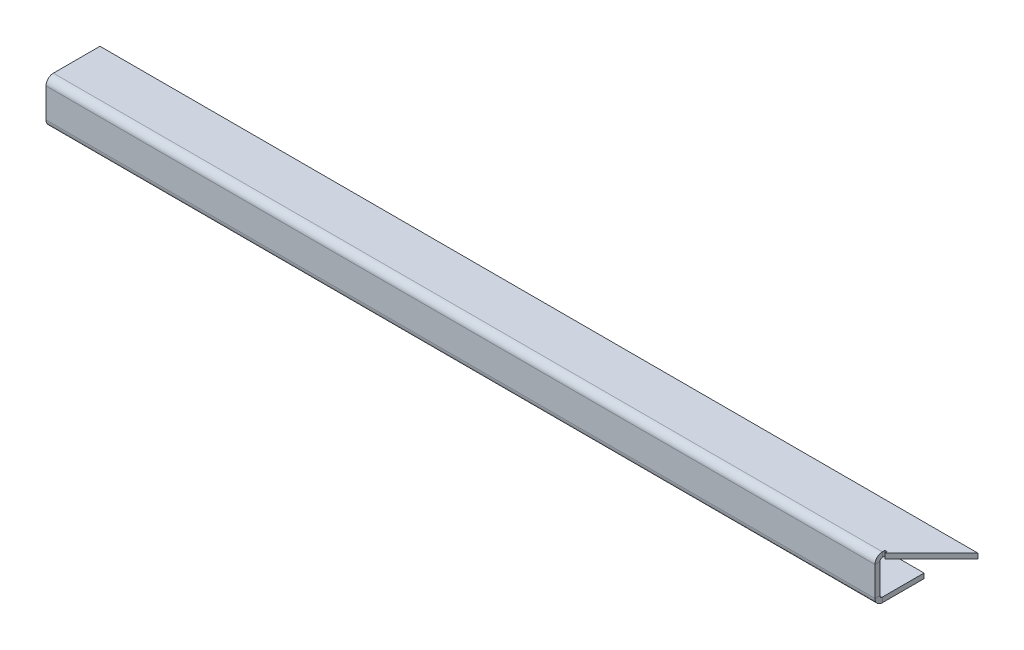
ISO-10303-21;
HEADER;
FILE_DESCRIPTION(('STEP AP214'),'2;1');
FILE_NAME('part.step','',(''),(''),'','','');
FILE_SCHEMA(('AUTOMOTIVE_DESIGN { 1 0 10303 214 1 1 1 1 }'));
ENDSEC;
DATA;
#1=APPLICATION_CONTEXT('core data for automotive mechanical design processes');
#2=APPLICATION_PROTOCOL_DEFINITION('international standard','automotive_design',2000,#1);
#3=PRODUCT_CONTEXT('',#1,'mechanical');
#4=PRODUCT('Part','Part','',(#3));
#5=PRODUCT_RELATED_PRODUCT_CATEGORY('part','',(#4));
#6=PRODUCT_DEFINITION_FORMATION('','',#4);
#7=PRODUCT_DEFINITION_CONTEXT('part definition',#1,'design');
#8=PRODUCT_DEFINITION('design','',#6,#7);
#9=PRODUCT_DEFINITION_SHAPE('','',#8);
#10=(LENGTH_UNIT() NAMED_UNIT(*) SI_UNIT(.MILLI.,.METRE.));
#11=(NAMED_UNIT(*) PLANE_ANGLE_UNIT() SI_UNIT($,.RADIAN.));
#12=(NAMED_UNIT(*) SI_UNIT($,.STERADIAN.) SOLID_ANGLE_UNIT());
#13=UNCERTAINTY_MEASURE_WITH_UNIT(LENGTH_MEASURE(1.E-05),#10,'distance_accuracy_value','');
#14=(GEOMETRIC_REPRESENTATION_CONTEXT(3) GLOBAL_UNCERTAINTY_ASSIGNED_CONTEXT((#13)) GLOBAL_UNIT_ASSIGNED_CONTEXT((#10,
#11,#12)) REPRESENTATION_CONTEXT('',''));
#15=CARTESIAN_POINT('',(0.,0.,0.));
#16=DIRECTION('',(0.,0.,1.));
#17=DIRECTION('',(1.,0.,0.));
#18=AXIS2_PLACEMENT_3D('',#15,#16,#17);
#19=CARTESIAN_POINT('',(-84.5,-8.,1.00000000000002));
#20=DIRECTION('',(1.,0.,0.));
#21=DIRECTION('',(0.,0.,-1.));
#22=AXIS2_PLACEMENT_3D('',#19,#20,#21);
#23=PLANE('',#22);
#24=DIRECTION('',(0.,0.,1.));
#25=VECTOR('',#24,1.);
#26=CARTESIAN_POINT('',(-84.5,-7.50000000000001,0.));
#27=LINE('',#26,#25);
#28=CARTESIAN_POINT('',(-84.5,-7.50000000000001,0.));
#29=VERTEX_POINT('',#28);
#30=CARTESIAN_POINT('',(-84.5,-7.5,1.00000000000003));
#31=VERTEX_POINT('',#30);
#32=EDGE_CURVE('E210',#29,#31,#27,.T.);
#33=ORIENTED_EDGE('',*,*,#32,.T.);
#34=DIRECTION('',(0.,-1.,0.));
#35=VECTOR('',#34,1.);
#36=CARTESIAN_POINT('',(-84.5,-8.,1.00000000000002));
#37=LINE('',#36,#35);
#38=CARTESIAN_POINT('',(-84.5,-1.50000000000001,0.999999999999986));
#39=VERTEX_POINT('',#38);
#40=EDGE_CURVE('E233',#39,#31,#37,.T.);
#41=ORIENTED_EDGE('',*,*,#40,.F.);
#42=DIRECTION('',(0.,0.,1.));
#43=VECTOR('',#42,1.);
#44=CARTESIAN_POINT('',(-84.5,-1.50000000000001,0.));
#45=LINE('',#44,#43);
#46=CARTESIAN_POINT('',(-84.5,-1.5,0.));
#47=VERTEX_POINT('',#46);
#48=EDGE_CURVE('E224',#47,#39,#45,.T.);
#49=ORIENTED_EDGE('',*,*,#48,.F.);
#50=DIRECTION('',(0.,-1.,0.));
#51=VECTOR('',#50,1.);
#52=CARTESIAN_POINT('',(-84.5,-8.,0.));
#53=LINE('',#52,#51);
#54=EDGE_CURVE('E232',#47,#29,#53,.T.);
#55=ORIENTED_EDGE('',*,*,#54,.T.);
#56=EDGE_LOOP('',(#33,#41,#49,#55));
#57=FACE_BOUND('',#56,.T.);
#58=ADVANCED_FACE('F45',(#57),#23,.F.);
#59=CARTESIAN_POINT('',(84.5,-0.999999999999997,0.999999999999969));
#60=DIRECTION('',(-1.,0.,0.));
#61=DIRECTION('',(0.,0.,1.));
#62=AXIS2_PLACEMENT_3D('',#59,#60,#61);
#63=PLANE('',#62);
#64=DIRECTION('',(0.,0.,1.));
#65=VECTOR('',#64,1.);
#66=CARTESIAN_POINT('',(84.5,-7.50000000000001,0.));
#67=LINE('',#66,#65);
#68=CARTESIAN_POINT('',(84.5,-7.50000000000001,0.));
#69=VERTEX_POINT('',#68);
#70=CARTESIAN_POINT('',(84.5,-7.50000000000001,0.999999999999993));
#71=VERTEX_POINT('',#70);
#72=EDGE_CURVE('E216',#69,#71,#67,.T.);
#73=ORIENTED_EDGE('',*,*,#72,.F.);
#74=DIRECTION('',(0.,1.,0.));
#75=VECTOR('',#74,1.);
#76=CARTESIAN_POINT('',(84.5,-1.,0.));
#77=LINE('',#76,#75);
#78=CARTESIAN_POINT('',(84.5,-1.5,0.));
#79=VERTEX_POINT('',#78);
#80=EDGE_CURVE('E236',#69,#79,#77,.T.);
#81=ORIENTED_EDGE('',*,*,#80,.T.);
#82=DIRECTION('',(0.,0.,1.));
#83=VECTOR('',#82,1.);
#84=CARTESIAN_POINT('',(84.5,-1.5,0.));
#85=LINE('',#84,#83);
#86=CARTESIAN_POINT('',(84.5,-1.5,0.999999999999971));
#87=VERTEX_POINT('',#86);
#88=EDGE_CURVE('E219',#79,#87,#85,.T.);
#89=ORIENTED_EDGE('',*,*,#88,.T.);
#90=DIRECTION('',(0.,1.,0.));
#91=VECTOR('',#90,1.);
#92=CARTESIAN_POINT('',(84.5,-0.999999999999997,0.999999999999969));
#93=LINE('',#92,#91);
#94=EDGE_CURVE('E235',#71,#87,#93,.T.);
#95=ORIENTED_EDGE('',*,*,#94,.F.);
#96=EDGE_LOOP('',(#73,#81,#89,#95));
#97=FACE_BOUND('',#96,.T.);
#98=ADVANCED_FACE('F353',(#97),#63,.F.);
#99=CARTESIAN_POINT('',(0.,0.,0.999999999999981));
#100=DIRECTION('',(0.,0.,-1.));
#101=DIRECTION('',(0.,1.,0.));
#102=AXIS2_PLACEMENT_3D('',#99,#100,#101);
#103=PLANE('',#102);
#104=DIRECTION('',(-1.,0.,0.));
#105=VECTOR('',#104,1.);
#106=CARTESIAN_POINT('',(-84.5,-7.5,1.00000000000003));
#107=LINE('',#106,#105);
#108=EDGE_CURVE('E163',#31,#71,#107,.F.);
#109=ORIENTED_EDGE('',*,*,#108,.T.);
#110=ORIENTED_EDGE('',*,*,#94,.T.);
#111=DIRECTION('',(1.,0.,0.));
#112=VECTOR('',#111,1.);
#113=CARTESIAN_POINT('',(0.,-1.5,0.999999999999986));
#114=LINE('',#113,#112);
#115=EDGE_CURVE('E227',#39,#87,#114,.T.);
#116=ORIENTED_EDGE('',*,*,#115,.F.);
#117=ORIENTED_EDGE('',*,*,#40,.T.);
#118=EDGE_LOOP('',(#109,#110,#116,#117));
#119=FACE_BOUND('',#118,.T.);
#120=ADVANCED_FACE('F359',(#119),#103,.F.);
#121=CARTESIAN_POINT('',(0.,0.,0.));
#122=DIRECTION('',(0.,0.,-1.));
#123=DIRECTION('',(0.,1.,0.));
#124=AXIS2_PLACEMENT_3D('',#121,#122,#123);
#125=PLANE('',#124);
#126=ORIENTED_EDGE('',*,*,#80,.F.);
#127=DIRECTION('',(-1.,0.,0.));
#128=VECTOR('',#127,1.);
#129=CARTESIAN_POINT('',(-84.5,-7.50000000000001,0.));
#130=LINE('',#129,#128);
#131=EDGE_CURVE('E62',#29,#69,#130,.F.);
#132=ORIENTED_EDGE('',*,*,#131,.F.);
#133=ORIENTED_EDGE('',*,*,#54,.F.);
#134=DIRECTION('',(-1.,0.,0.));
#135=VECTOR('',#134,1.);
#136=CARTESIAN_POINT('',(84.5,-1.5,0.));
#137=LINE('',#136,#135);
#138=EDGE_CURVE('E222',#79,#47,#137,.T.);
#139=ORIENTED_EDGE('',*,*,#138,.F.);
#140=EDGE_LOOP('',(#126,#132,#133,#139));
#141=FACE_BOUND('',#140,.T.);
#142=ADVANCED_FACE('F409',(#141),#125,.T.);
#143=CARTESIAN_POINT('',(-84.5,-1.,0.));
#144=DIRECTION('',(-1.,0.,0.));
#145=DIRECTION('',(0.,0.,1.));
#146=AXIS2_PLACEMENT_3D('',#143,#144,#145);
#147=PLANE('',#146);
#148=DIRECTION('',(0.,0.,1.));
#149=VECTOR('',#148,1.);
#150=CARTESIAN_POINT('',(-84.5,-1.,0.));
#151=LINE('',#150,#149);
#152=CARTESIAN_POINT('',(-84.5,-1.,-10.));
#153=VERTEX_POINT('',#152);
#154=CARTESIAN_POINT('',(-84.5,-1.,-0.500000000000017));
#155=VERTEX_POINT('',#154);
#156=EDGE_CURVE('E280',#153,#155,#151,.T.);
#157=ORIENTED_EDGE('',*,*,#156,.T.);
#158=DIRECTION('',(0.,1.,0.));
#159=VECTOR('',#158,1.);
#160=CARTESIAN_POINT('',(-84.5,-1.,-0.499999999999998));
#161=LINE('',#160,#159);
#162=CARTESIAN_POINT('',(-84.5,0.,-0.500000000000004));
#163=VERTEX_POINT('',#162);
#164=EDGE_CURVE('E247',#155,#163,#161,.T.);
#165=ORIENTED_EDGE('',*,*,#164,.T.);
#166=DIRECTION('',(0.,0.,1.));
#167=VECTOR('',#166,1.);
#168=CARTESIAN_POINT('',(-84.5,0.,0.));
#169=LINE('',#168,#167);
#170=CARTESIAN_POINT('',(-84.5,0.,-10.));
#171=VERTEX_POINT('',#170);
#172=EDGE_CURVE('E265',#171,#163,#169,.T.);
#173=ORIENTED_EDGE('',*,*,#172,.F.);
#174=DIRECTION('',(0.,1.,0.));
#175=VECTOR('',#174,1.);
#176=CARTESIAN_POINT('',(-84.5,-1.,-10.));
#177=LINE('',#176,#175);
#178=EDGE_CURVE('E295',#153,#171,#177,.T.);
#179=ORIENTED_EDGE('',*,*,#178,.F.);
#180=EDGE_LOOP('',(#157,#165,#173,#179));
#181=FACE_BOUND('',#180,.T.);
#182=ADVANCED_FACE('F47',(#181),#147,.T.);
#183=CARTESIAN_POINT('',(84.5,-1.,0.));
#184=DIRECTION('',(0.707106781186544,0.,0.707106781186551));
#185=DIRECTION('',(0.707106781186551,0.,-0.707106781186544));
#186=AXIS2_PLACEMENT_3D('',#183,#184,#185);
#187=PLANE('',#186);
#188=DIRECTION('',(0.707106781186551,0.,-0.707106781186544));
#189=VECTOR('',#188,1.);
#190=CARTESIAN_POINT('',(84.5,0.,0.));
#191=LINE('',#190,#189);
#192=CARTESIAN_POINT('',(85.,0.,-0.500000000000026));
#193=VERTEX_POINT('',#192);
#194=CARTESIAN_POINT('',(94.5000000000001,0.,-10.));
#195=VERTEX_POINT('',#194);
#196=EDGE_CURVE('E291',#193,#195,#191,.T.);
#197=ORIENTED_EDGE('',*,*,#196,.F.);
#198=DIRECTION('',(0.,1.,0.));
#199=VECTOR('',#198,1.);
#200=CARTESIAN_POINT('',(85.,-1.,-0.500000000000026));
#201=LINE('',#200,#199);
#202=CARTESIAN_POINT('',(85.,-1.,-0.500000000000026));
#203=VERTEX_POINT('',#202);
#204=EDGE_CURVE('E273',#203,#193,#201,.T.);
#205=ORIENTED_EDGE('',*,*,#204,.F.);
#206=DIRECTION('',(0.707106781186551,0.,-0.707106781186544));
#207=VECTOR('',#206,1.);
#208=CARTESIAN_POINT('',(84.5,-1.,0.));
#209=LINE('',#208,#207);
#210=CARTESIAN_POINT('',(94.5000000000001,-1.,-10.));
#211=VERTEX_POINT('',#210);
#212=EDGE_CURVE('E283',#203,#211,#209,.T.);
#213=ORIENTED_EDGE('',*,*,#212,.T.);
#214=DIRECTION('',(0.,1.,0.));
#215=VECTOR('',#214,1.);
#216=CARTESIAN_POINT('',(94.5000000000001,-1.,-10.));
#217=LINE('',#216,#215);
#218=EDGE_CURVE('E289',#211,#195,#217,.T.);
#219=ORIENTED_EDGE('',*,*,#218,.T.);
#220=EDGE_LOOP('',(#197,#205,#213,#219));
#221=FACE_BOUND('',#220,.T.);
#222=ADVANCED_FACE('F398',(#221),#187,.T.);
#223=CARTESIAN_POINT('',(0.,-1.,0.));
#224=DIRECTION('',(0.,-1.,0.));
#225=DIRECTION('',(0.,0.,-1.));
#226=AXIS2_PLACEMENT_3D('',#223,#224,#225);
#227=PLANE('',#226);
#228=DIRECTION('',(0.,0.,-1.));
#229=VECTOR('',#228,1.);
#230=CARTESIAN_POINT('',(84.5,-1.,-0.500000000000035));
#231=LINE('',#230,#229);
#232=CARTESIAN_POINT('',(84.5,-1.,-0.500000000000035));
#233=VERTEX_POINT('',#232);
#234=CARTESIAN_POINT('',(84.5,-1.,-1.00000000000003));
#235=VERTEX_POINT('',#234);
#236=EDGE_CURVE('E70',#233,#235,#231,.T.);
#237=ORIENTED_EDGE('',*,*,#236,.F.);
#238=DIRECTION('',(-1.,0.,0.));
#239=VECTOR('',#238,1.);
#240=CARTESIAN_POINT('',(-84.5,-1.,-0.499999999999998));
#241=LINE('',#240,#239);
#242=EDGE_CURVE('E253',#155,#233,#241,.F.);
#243=ORIENTED_EDGE('',*,*,#242,.F.);
#244=ORIENTED_EDGE('',*,*,#156,.F.);
#245=DIRECTION('',(-1.,0.,0.));
#246=VECTOR('',#245,1.);
#247=CARTESIAN_POINT('',(-84.5,-1.,-10.));
#248=LINE('',#247,#246);
#249=EDGE_CURVE('E286',#211,#153,#248,.T.);
#250=ORIENTED_EDGE('',*,*,#249,.F.);
#251=ORIENTED_EDGE('',*,*,#212,.F.);
#252=DIRECTION('',(0.,0.,1.));
#253=VECTOR('',#252,1.);
#254=CARTESIAN_POINT('',(85.,-1.,-1.00000000000003));
#255=LINE('',#254,#253);
#256=CARTESIAN_POINT('',(85.,-1.,-1.00000000000003));
#257=VERTEX_POINT('',#256);
#258=EDGE_CURVE('E270',#257,#203,#255,.T.);
#259=ORIENTED_EDGE('',*,*,#258,.F.);
#260=DIRECTION('',(1.,0.,0.));
#261=VECTOR('',#260,1.);
#262=CARTESIAN_POINT('',(84.5,-1.,-1.00000000000003));
#263=LINE('',#262,#261);
#264=EDGE_CURVE('E266',#235,#257,#263,.T.);
#265=ORIENTED_EDGE('',*,*,#264,.F.);
#266=EDGE_LOOP('',(#237,#243,#244,#250,#251,#259,#265));
#267=FACE_BOUND('',#266,.T.);
#268=ADVANCED_FACE('F394',(#267),#227,.T.);
#269=CARTESIAN_POINT('',(0.,0.,0.));
#270=DIRECTION('',(0.,-1.,0.));
#271=DIRECTION('',(0.,0.,-1.));
#272=AXIS2_PLACEMENT_3D('',#269,#270,#271);
#273=PLANE('',#272);
#274=DIRECTION('',(-1.,0.,0.));
#275=VECTOR('',#274,1.);
#276=CARTESIAN_POINT('',(-84.5,0.,-0.500000000000004));
#277=LINE('',#276,#275);
#278=CARTESIAN_POINT('',(84.5,0.,-0.500000000000035));
#279=VERTEX_POINT('',#278);
#280=EDGE_CURVE('E241',#163,#279,#277,.F.);
#281=ORIENTED_EDGE('',*,*,#280,.T.);
#282=DIRECTION('',(0.,0.,1.));
#283=VECTOR('',#282,1.);
#284=CARTESIAN_POINT('',(84.5,0.,0.));
#285=LINE('',#284,#283);
#286=CARTESIAN_POINT('',(84.5,0.,-1.00000000000003));
#287=VERTEX_POINT('',#286);
#288=EDGE_CURVE('E11',#287,#279,#285,.T.);
#289=ORIENTED_EDGE('',*,*,#288,.F.);
#290=DIRECTION('',(-1.,0.,0.));
#291=VECTOR('',#290,1.);
#292=CARTESIAN_POINT('',(0.,0.,-1.00000000000003));
#293=LINE('',#292,#291);
#294=CARTESIAN_POINT('',(85.,0.,-1.00000000000003));
#295=VERTEX_POINT('',#294);
#296=EDGE_CURVE('E54',#295,#287,#293,.T.);
#297=ORIENTED_EDGE('',*,*,#296,.F.);
#298=DIRECTION('',(0.,0.,-1.));
#299=VECTOR('',#298,1.);
#300=CARTESIAN_POINT('',(85.,0.,0.));
#301=LINE('',#300,#299);
#302=EDGE_CURVE('E297',#193,#295,#301,.T.);
#303=ORIENTED_EDGE('',*,*,#302,.F.);
#304=ORIENTED_EDGE('',*,*,#196,.T.);
#305=DIRECTION('',(-1.,0.,0.));
#306=VECTOR('',#305,1.);
#307=CARTESIAN_POINT('',(-84.5,0.,-10.));
#308=LINE('',#307,#306);
#309=EDGE_CURVE('E284',#195,#171,#308,.T.);
#310=ORIENTED_EDGE('',*,*,#309,.T.);
#311=ORIENTED_EDGE('',*,*,#172,.T.);
#312=EDGE_LOOP('',(#281,#289,#297,#303,#304,#310,#311));
#313=FACE_BOUND('',#312,.T.);
#314=ADVANCED_FACE('F397',(#313),#273,.F.);
#315=CARTESIAN_POINT('',(-84.5,-1.,-10.));
#316=DIRECTION('',(0.,0.,-1.));
#317=DIRECTION('',(-1.,0.,0.));
#318=AXIS2_PLACEMENT_3D('',#315,#316,#317);
#319=PLANE('',#318);
#320=ORIENTED_EDGE('',*,*,#309,.F.);
#321=ORIENTED_EDGE('',*,*,#218,.F.);
#322=ORIENTED_EDGE('',*,*,#249,.T.);
#323=ORIENTED_EDGE('',*,*,#178,.T.);
#324=EDGE_LOOP('',(#320,#321,#322,#323));
#325=FACE_BOUND('',#324,.T.);
#326=ADVANCED_FACE('F392',(#325),#319,.T.);
#327=CARTESIAN_POINT('',(84.5,-1.,-0.500000000000035));
#328=DIRECTION('',(1.,0.,0.));
#329=DIRECTION('',(0.,0.,-1.));
#330=AXIS2_PLACEMENT_3D('',#327,#328,#329);
#331=PLANE('',#330);
#332=DIRECTION('',(0.,1.,0.));
#333=VECTOR('',#332,1.);
#334=CARTESIAN_POINT('',(84.5,-1.,-1.00000000000003));
#335=LINE('',#334,#333);
#336=EDGE_CURVE('E269',#235,#287,#335,.T.);
#337=ORIENTED_EDGE('',*,*,#336,.T.);
#338=ORIENTED_EDGE('',*,*,#288,.T.);
#339=DIRECTION('',(0.,1.,0.));
#340=VECTOR('',#339,1.);
#341=CARTESIAN_POINT('',(84.5,-1.,-0.500000000000035));
#342=LINE('',#341,#340);
#343=EDGE_CURVE('E258',#233,#279,#342,.T.);
#344=ORIENTED_EDGE('',*,*,#343,.F.);
#345=ORIENTED_EDGE('',*,*,#236,.T.);
#346=EDGE_LOOP('',(#337,#338,#344,#345));
#347=FACE_BOUND('',#346,.T.);
#348=ADVANCED_FACE('F388',(#347),#331,.T.);
#349=CARTESIAN_POINT('',(84.5,-1.,-1.00000000000003));
#350=DIRECTION('',(0.,0.,1.));
#351=DIRECTION('',(0.,-1.,0.));
#352=AXIS2_PLACEMENT_3D('',#349,#350,#351);
#353=PLANE('',#352);
#354=DIRECTION('',(0.,1.,0.));
#355=VECTOR('',#354,1.);
#356=CARTESIAN_POINT('',(85.,-1.,-1.00000000000003));
#357=LINE('',#356,#355);
#358=EDGE_CURVE('E261',#257,#295,#357,.T.);
#359=ORIENTED_EDGE('',*,*,#358,.T.);
#360=ORIENTED_EDGE('',*,*,#296,.T.);
#361=ORIENTED_EDGE('',*,*,#336,.F.);
#362=ORIENTED_EDGE('',*,*,#264,.T.);
#363=EDGE_LOOP('',(#359,#360,#361,#362));
#364=FACE_BOUND('',#363,.T.);
#365=ADVANCED_FACE('F384',(#364),#353,.T.);
#366=CARTESIAN_POINT('',(85.,-1.,-1.00000000000003));
#367=DIRECTION('',(-1.,0.,0.));
#368=DIRECTION('',(0.,0.,1.));
#369=AXIS2_PLACEMENT_3D('',#366,#367,#368);
#370=PLANE('',#369);
#371=ORIENTED_EDGE('',*,*,#204,.T.);
#372=ORIENTED_EDGE('',*,*,#302,.T.);
#373=ORIENTED_EDGE('',*,*,#358,.F.);
#374=ORIENTED_EDGE('',*,*,#258,.T.);
#375=EDGE_LOOP('',(#371,#372,#373,#374));
#376=FACE_BOUND('',#375,.T.);
#377=ADVANCED_FACE('F377',(#376),#370,.T.);
#378=CARTESIAN_POINT('',(84.5,-1.5,-0.500000000000032));
#379=DIRECTION('',(1.,0.,0.));
#380=DIRECTION('',(0.,0.,-1.));
#381=AXIS2_PLACEMENT_3D('',#378,#379,#380);
#382=PLANE('',#381);
#383=ORIENTED_EDGE('',*,*,#88,.F.);
#384=CARTESIAN_POINT('',(84.5,-1.5,-0.500000000000032));
#385=DIRECTION('',(-1.,0.,0.));
#386=DIRECTION('',(0.,0.,1.));
#387=AXIS2_PLACEMENT_3D('',#384,#385,#386);
#388=CIRCLE('',#387,0.500000000000003);
#389=EDGE_CURVE('E250',#233,#79,#388,.F.);
#390=ORIENTED_EDGE('',*,*,#389,.F.);
#391=ORIENTED_EDGE('',*,*,#343,.T.);
#392=CARTESIAN_POINT('',(84.5,-1.5,-0.500000000000032));
#393=DIRECTION('',(-1.,0.,0.));
#394=DIRECTION('',(0.,0.,1.));
#395=AXIS2_PLACEMENT_3D('',#392,#393,#394);
#396=CIRCLE('',#395,1.5);
#397=EDGE_CURVE('E243',#279,#87,#396,.F.);
#398=ORIENTED_EDGE('',*,*,#397,.T.);
#399=EDGE_LOOP('',(#383,#390,#391,#398));
#400=FACE_BOUND('',#399,.T.);
#401=ADVANCED_FACE('F374',(#400),#382,.T.);
#402=CARTESIAN_POINT('',(-84.5,-1.5,-0.499999999999995));
#403=DIRECTION('',(1.,0.,0.));
#404=DIRECTION('',(0.,0.,-1.));
#405=AXIS2_PLACEMENT_3D('',#402,#403,#404);
#406=PLANE('',#405);
#407=CARTESIAN_POINT('',(-84.5,-1.5,-0.499999999999995));
#408=DIRECTION('',(-1.,0.,0.));
#409=DIRECTION('',(0.,0.,1.));
#410=AXIS2_PLACEMENT_3D('',#407,#408,#409);
#411=CIRCLE('',#410,0.500000000000003);
#412=EDGE_CURVE('E238',#47,#155,#411,.T.);
#413=ORIENTED_EDGE('',*,*,#412,.F.);
#414=ORIENTED_EDGE('',*,*,#48,.T.);
#415=CARTESIAN_POINT('',(-84.5,-1.5,-0.499999999999995));
#416=DIRECTION('',(-1.,0.,0.));
#417=DIRECTION('',(0.,0.,1.));
#418=AXIS2_PLACEMENT_3D('',#415,#416,#417);
#419=CIRCLE('',#418,1.5);
#420=EDGE_CURVE('E244',#39,#163,#419,.T.);
#421=ORIENTED_EDGE('',*,*,#420,.T.);
#422=ORIENTED_EDGE('',*,*,#164,.F.);
#423=EDGE_LOOP('',(#413,#414,#421,#422));
#424=FACE_BOUND('',#423,.T.);
#425=ADVANCED_FACE('F368',(#424),#406,.F.);
#426=CARTESIAN_POINT('',(-84.5,-1.5,-0.499999999999995));
#427=DIRECTION('',(-1.,0.,0.));
#428=DIRECTION('',(0.,0.,1.));
#429=AXIS2_PLACEMENT_3D('',#426,#427,#428);
#430=CYLINDRICAL_SURFACE('',#429,1.5);
#431=ORIENTED_EDGE('',*,*,#280,.F.);
#432=ORIENTED_EDGE('',*,*,#420,.F.);
#433=ORIENTED_EDGE('',*,*,#115,.T.);
#434=ORIENTED_EDGE('',*,*,#397,.F.);
#435=EDGE_LOOP('',(#431,#432,#433,#434));
#436=FACE_BOUND('',#435,.T.);
#437=ADVANCED_FACE('F364',(#436),#430,.T.);
#438=CARTESIAN_POINT('',(-84.5,-1.5,-0.499999999999995));
#439=DIRECTION('',(-1.,0.,0.));
#440=DIRECTION('',(0.,0.,1.));
#441=AXIS2_PLACEMENT_3D('',#438,#439,#440);
#442=CYLINDRICAL_SURFACE('',#441,0.500000000000003);
#443=ORIENTED_EDGE('',*,*,#242,.T.);
#444=ORIENTED_EDGE('',*,*,#389,.T.);
#445=ORIENTED_EDGE('',*,*,#138,.T.);
#446=ORIENTED_EDGE('',*,*,#412,.T.);
#447=EDGE_LOOP('',(#443,#444,#445,#446));
#448=FACE_BOUND('',#447,.T.);
#449=ADVANCED_FACE('F367',(#448),#442,.F.);
#450=CARTESIAN_POINT('',(84.5,-7.50000000000001,-0.500000000000012));
#451=DIRECTION('',(1.,0.,0.));
#452=DIRECTION('',(0.,0.,-1.));
#453=AXIS2_PLACEMENT_3D('',#450,#451,#452);
#454=PLANE('',#453);
#455=DIRECTION('',(0.,-1.,0.));
#456=VECTOR('',#455,1.);
#457=CARTESIAN_POINT('',(84.5,-8.00000000000001,-0.500000000000006));
#458=LINE('',#457,#456);
#459=CARTESIAN_POINT('',(84.5,-8.00000000000001,-0.500000000000008));
#460=VERTEX_POINT('',#459);
#461=CARTESIAN_POINT('',(84.5,-9.00000000000001,-0.500000000000001));
#462=VERTEX_POINT('',#461);
#463=EDGE_CURVE('E312',#460,#462,#458,.T.);
#464=ORIENTED_EDGE('',*,*,#463,.F.);
#465=CARTESIAN_POINT('',(84.5,-7.50000000000001,-0.500000000000012));
#466=DIRECTION('',(-1.,0.,0.));
#467=DIRECTION('',(0.,0.,1.));
#468=AXIS2_PLACEMENT_3D('',#465,#466,#467);
#469=CIRCLE('',#468,0.5);
#470=EDGE_CURVE('E166',#69,#460,#469,.F.);
#471=ORIENTED_EDGE('',*,*,#470,.F.);
#472=ORIENTED_EDGE('',*,*,#72,.T.);
#473=CARTESIAN_POINT('',(84.5,-7.50000000000001,-0.500000000000012));
#474=DIRECTION('',(-1.,0.,0.));
#475=DIRECTION('',(0.,0.,1.));
#476=AXIS2_PLACEMENT_3D('',#473,#474,#475);
#477=CIRCLE('',#476,1.5);
#478=EDGE_CURVE('E209',#71,#462,#477,.F.);
#479=ORIENTED_EDGE('',*,*,#478,.T.);
#480=EDGE_LOOP('',(#464,#471,#472,#479));
#481=FACE_BOUND('',#480,.T.);
#482=ADVANCED_FACE('F372',(#481),#454,.T.);
#483=CARTESIAN_POINT('',(-84.5,-7.50000000000001,-0.499999999999975));
#484=DIRECTION('',(1.,0.,0.));
#485=DIRECTION('',(0.,0.,-1.));
#486=AXIS2_PLACEMENT_3D('',#483,#484,#485);
#487=PLANE('',#486);
#488=CARTESIAN_POINT('',(-84.5,-7.50000000000001,-0.499999999999975));
#489=DIRECTION('',(-1.,0.,0.));
#490=DIRECTION('',(0.,0.,1.));
#491=AXIS2_PLACEMENT_3D('',#488,#489,#490);
#492=CIRCLE('',#491,0.5);
#493=CARTESIAN_POINT('',(-84.5,-8.00000000000001,-0.499999999999972));
#494=VERTEX_POINT('',#493);
#495=EDGE_CURVE('E173',#494,#29,#492,.T.);
#496=ORIENTED_EDGE('',*,*,#495,.F.);
#497=DIRECTION('',(0.,-1.,0.));
#498=VECTOR('',#497,1.);
#499=CARTESIAN_POINT('',(-84.5,-8.00000000000001,-0.499999999999974));
#500=LINE('',#499,#498);
#501=CARTESIAN_POINT('',(-84.5,-9.00000000000001,-0.499999999999967));
#502=VERTEX_POINT('',#501);
#503=EDGE_CURVE('E170',#494,#502,#500,.T.);
#504=ORIENTED_EDGE('',*,*,#503,.T.);
#505=CARTESIAN_POINT('',(-84.5,-7.50000000000001,-0.499999999999975));
#506=DIRECTION('',(-1.,0.,0.));
#507=DIRECTION('',(0.,0.,1.));
#508=AXIS2_PLACEMENT_3D('',#505,#506,#507);
#509=CIRCLE('',#508,1.5);
#510=EDGE_CURVE('E156',#502,#31,#509,.T.);
#511=ORIENTED_EDGE('',*,*,#510,.T.);
#512=ORIENTED_EDGE('',*,*,#32,.F.);
#513=EDGE_LOOP('',(#496,#504,#511,#512));
#514=FACE_BOUND('',#513,.T.);
#515=ADVANCED_FACE('F171',(#514),#487,.F.);
#516=CARTESIAN_POINT('',(-84.5,-7.50000000000001,-0.499999999999975));
#517=DIRECTION('',(-1.,0.,0.));
#518=DIRECTION('',(0.,-1.,0.));
#519=AXIS2_PLACEMENT_3D('',#516,#517,#518);
#520=CYLINDRICAL_SURFACE('',#519,1.5);
#521=ORIENTED_EDGE('',*,*,#108,.F.);
#522=ORIENTED_EDGE('',*,*,#510,.F.);
#523=DIRECTION('',(1.,0.,0.));
#524=VECTOR('',#523,1.);
#525=CARTESIAN_POINT('',(0.,-9.00000000000001,-0.499999999999983));
#526=LINE('',#525,#524);
#527=EDGE_CURVE('E161',#502,#462,#526,.T.);
#528=ORIENTED_EDGE('',*,*,#527,.T.);
#529=ORIENTED_EDGE('',*,*,#478,.F.);
#530=EDGE_LOOP('',(#521,#522,#528,#529));
#531=FACE_BOUND('',#530,.T.);
#532=ADVANCED_FACE('F158',(#531),#520,.T.);
#533=CARTESIAN_POINT('',(-84.5,-7.50000000000001,-0.499999999999975));
#534=DIRECTION('',(-1.,0.,0.));
#535=DIRECTION('',(0.,-1.,0.));
#536=AXIS2_PLACEMENT_3D('',#533,#534,#535);
#537=CYLINDRICAL_SURFACE('',#536,0.5);
#538=ORIENTED_EDGE('',*,*,#131,.T.);
#539=ORIENTED_EDGE('',*,*,#470,.T.);
#540=DIRECTION('',(-1.,0.,0.));
#541=VECTOR('',#540,1.);
#542=CARTESIAN_POINT('',(84.5,-8.00000000000001,-0.500000000000006));
#543=LINE('',#542,#541);
#544=EDGE_CURVE('E177',#460,#494,#543,.T.);
#545=ORIENTED_EDGE('',*,*,#544,.T.);
#546=ORIENTED_EDGE('',*,*,#495,.T.);
#547=EDGE_LOOP('',(#538,#539,#545,#546));
#548=FACE_BOUND('',#547,.T.);
#549=ADVANCED_FACE('F430',(#548),#537,.F.);
#550=CARTESIAN_POINT('',(-84.5,-9.00000000000007,-8.99999999999997));
#551=DIRECTION('',(1.,0.,0.));
#552=DIRECTION('',(0.,1.,0.));
#553=AXIS2_PLACEMENT_3D('',#550,#551,#552);
#554=PLANE('',#553);
#555=ORIENTED_EDGE('',*,*,#503,.F.);
#556=DIRECTION('',(0.,0.,-1.));
#557=VECTOR('',#556,1.);
#558=CARTESIAN_POINT('',(-84.5,-8.00000000000007,-8.99999999999998));
#559=LINE('',#558,#557);
#560=CARTESIAN_POINT('',(-84.5,-8.00000000000007,-8.99999999999998));
#561=VERTEX_POINT('',#560);
#562=EDGE_CURVE('E186',#494,#561,#559,.T.);
#563=ORIENTED_EDGE('',*,*,#562,.T.);
#564=DIRECTION('',(0.,1.,0.));
#565=VECTOR('',#564,1.);
#566=CARTESIAN_POINT('',(-84.5,-9.00000000000007,-8.99999999999997));
#567=LINE('',#566,#565);
#568=CARTESIAN_POINT('',(-84.5,-9.00000000000007,-8.99999999999997));
#569=VERTEX_POINT('',#568);
#570=EDGE_CURVE('E190',#569,#561,#567,.T.);
#571=ORIENTED_EDGE('',*,*,#570,.F.);
#572=DIRECTION('',(0.,0.,-1.));
#573=VECTOR('',#572,1.);
#574=CARTESIAN_POINT('',(-84.5,-9.00000000000007,-8.99999999999997));
#575=LINE('',#574,#573);
#576=EDGE_CURVE('E182',#502,#569,#575,.T.);
#577=ORIENTED_EDGE('',*,*,#576,.F.);
#578=EDGE_LOOP('',(#555,#563,#571,#577));
#579=FACE_BOUND('',#578,.T.);
#580=ADVANCED_FACE('F188',(#579),#554,.F.);
#581=CARTESIAN_POINT('',(84.5,-9.00000000000001,0.));
#582=DIRECTION('',(-1.,0.,0.));
#583=DIRECTION('',(0.,-1.,0.));
#584=AXIS2_PLACEMENT_3D('',#581,#582,#583);
#585=PLANE('',#584);
#586=ORIENTED_EDGE('',*,*,#463,.T.);
#587=DIRECTION('',(0.,0.,1.));
#588=VECTOR('',#587,1.);
#589=CARTESIAN_POINT('',(84.5,-9.00000000000001,0.));
#590=LINE('',#589,#588);
#591=CARTESIAN_POINT('',(84.5,-9.00000000000007,-9.00000000000001));
#592=VERTEX_POINT('',#591);
#593=EDGE_CURVE('E185',#592,#462,#590,.T.);
#594=ORIENTED_EDGE('',*,*,#593,.F.);
#595=DIRECTION('',(0.,1.,0.));
#596=VECTOR('',#595,1.);
#597=CARTESIAN_POINT('',(84.5,-9.00000000000007,-9.00000000000001));
#598=LINE('',#597,#596);
#599=CARTESIAN_POINT('',(84.5,-8.00000000000007,-9.00000000000001));
#600=VERTEX_POINT('',#599);
#601=EDGE_CURVE('E202',#592,#600,#598,.T.);
#602=ORIENTED_EDGE('',*,*,#601,.T.);
#603=DIRECTION('',(0.,0.,1.));
#604=VECTOR('',#603,1.);
#605=CARTESIAN_POINT('',(84.5,-8.,0.));
#606=LINE('',#605,#604);
#607=EDGE_CURVE('E193',#600,#460,#606,.T.);
#608=ORIENTED_EDGE('',*,*,#607,.T.);
#609=EDGE_LOOP('',(#586,#594,#602,#608));
#610=FACE_BOUND('',#609,.T.);
#611=ADVANCED_FACE('F333',(#610),#585,.F.);
#612=CARTESIAN_POINT('',(0.,-9.00000000000001,0.));
#613=DIRECTION('',(0.,1.,0.));
#614=DIRECTION('',(0.,0.,1.));
#615=AXIS2_PLACEMENT_3D('',#612,#613,#614);
#616=PLANE('',#615);
#617=CARTESIAN_POINT('',(-74.5,-9.00000000000004,-4.99999999999997));
#618=DIRECTION('',(0.,-1.,0.));
#619=DIRECTION('',(0.,0.,-1.));
#620=AXIS2_PLACEMENT_3D('',#617,#618,#619);
#621=CIRCLE('',#620,1.5);
#622=CARTESIAN_POINT('',(-74.5,-9.00000000000005,-6.49999999999997));
#623=VERTEX_POINT('',#622);
#624=EDGE_CURVE('E307',#623,#623,#621,.T.);
#625=ORIENTED_EDGE('',*,*,#624,.F.);
#626=EDGE_LOOP('',(#625));
#627=FACE_BOUND('',#626,.T.);
#628=CARTESIAN_POINT('',(0.,-9.00000000000004,-4.99999999999997));
#629=DIRECTION('',(0.,-1.,0.));
#630=DIRECTION('',(0.,0.,-1.));
#631=AXIS2_PLACEMENT_3D('',#628,#629,#630);
#632=CIRCLE('',#631,1.5);
#633=CARTESIAN_POINT('',(0.,-9.00000000000005,-6.49999999999998));
#634=VERTEX_POINT('',#633);
#635=EDGE_CURVE('E322',#634,#634,#632,.T.);
#636=ORIENTED_EDGE('',*,*,#635,.F.);
#637=EDGE_LOOP('',(#636));
#638=FACE_BOUND('',#637,.T.);
#639=CARTESIAN_POINT('',(74.5000000000001,-9.00000000000004,-4.99999999999997));
#640=DIRECTION('',(0.,-1.,0.));
#641=DIRECTION('',(0.,0.,-1.));
#642=AXIS2_PLACEMENT_3D('',#639,#640,#641);
#643=CIRCLE('',#642,1.5);
#644=CARTESIAN_POINT('',(74.5000000000001,-9.00000000000005,-6.49999999999997));
#645=VERTEX_POINT('',#644);
#646=EDGE_CURVE('E319',#645,#645,#643,.T.);
#647=ORIENTED_EDGE('',*,*,#646,.F.);
#648=EDGE_LOOP('',(#647));
#649=FACE_BOUND('',#648,.T.);
#650=ORIENTED_EDGE('',*,*,#527,.F.);
#651=ORIENTED_EDGE('',*,*,#576,.T.);
#652=DIRECTION('',(1.,0.,0.));
#653=VECTOR('',#652,1.);
#654=CARTESIAN_POINT('',(84.5,-9.00000000000007,-9.00000000000001));
#655=LINE('',#654,#653);
#656=EDGE_CURVE('E192',#569,#592,#655,.T.);
#657=ORIENTED_EDGE('',*,*,#656,.T.);
#658=ORIENTED_EDGE('',*,*,#593,.T.);
#659=EDGE_LOOP('',(#650,#651,#657,#658));
#660=FACE_BOUND('',#659,.T.);
#661=ADVANCED_FACE('F181',(#627,#638,#649,#660),#616,.F.);
#662=CARTESIAN_POINT('',(0.,-8.,0.));
#663=DIRECTION('',(0.,1.,0.));
#664=DIRECTION('',(0.,0.,1.));
#665=AXIS2_PLACEMENT_3D('',#662,#663,#664);
#666=PLANE('',#665);
#667=CARTESIAN_POINT('',(-74.5,-8.00000000000004,-4.99999999999998));
#668=DIRECTION('',(0.,1.,0.));
#669=DIRECTION('',(0.,0.,1.));
#670=AXIS2_PLACEMENT_3D('',#667,#668,#669);
#671=CIRCLE('',#670,1.5);
#672=CARTESIAN_POINT('',(-74.5,-8.00000000000003,-3.49999999999998));
#673=VERTEX_POINT('',#672);
#674=EDGE_CURVE('E49',#673,#673,#671,.T.);
#675=ORIENTED_EDGE('',*,*,#674,.F.);
#676=EDGE_LOOP('',(#675));
#677=FACE_BOUND('',#676,.T.);
#678=CARTESIAN_POINT('',(0.,-8.00000000000004,-4.99999999999998));
#679=DIRECTION('',(0.,1.,0.));
#680=DIRECTION('',(0.,0.,1.));
#681=AXIS2_PLACEMENT_3D('',#678,#679,#680);
#682=CIRCLE('',#681,1.5);
#683=CARTESIAN_POINT('',(0.,-8.00000000000003,-3.49999999999998));
#684=VERTEX_POINT('',#683);
#685=EDGE_CURVE('E306',#684,#684,#682,.T.);
#686=ORIENTED_EDGE('',*,*,#685,.F.);
#687=EDGE_LOOP('',(#686));
#688=FACE_BOUND('',#687,.T.);
#689=CARTESIAN_POINT('',(74.5000000000001,-8.00000000000004,-4.99999999999998));
#690=DIRECTION('',(0.,1.,0.));
#691=DIRECTION('',(0.,0.,1.));
#692=AXIS2_PLACEMENT_3D('',#689,#690,#691);
#693=CIRCLE('',#692,1.5);
#694=CARTESIAN_POINT('',(74.5000000000001,-8.00000000000003,-3.49999999999998));
#695=VERTEX_POINT('',#694);
#696=EDGE_CURVE('E304',#695,#695,#693,.T.);
#697=ORIENTED_EDGE('',*,*,#696,.F.);
#698=EDGE_LOOP('',(#697));
#699=FACE_BOUND('',#698,.T.);
#700=ORIENTED_EDGE('',*,*,#562,.F.);
#701=ORIENTED_EDGE('',*,*,#544,.F.);
#702=ORIENTED_EDGE('',*,*,#607,.F.);
#703=DIRECTION('',(1.,0.,0.));
#704=VECTOR('',#703,1.);
#705=CARTESIAN_POINT('',(84.5,-8.00000000000007,-9.00000000000001));
#706=LINE('',#705,#704);
#707=EDGE_CURVE('E197',#561,#600,#706,.T.);
#708=ORIENTED_EDGE('',*,*,#707,.F.);
#709=EDGE_LOOP('',(#700,#701,#702,#708));
#710=FACE_BOUND('',#709,.T.);
#711=ADVANCED_FACE('F332',(#677,#688,#699,#710),#666,.T.);
#712=CARTESIAN_POINT('',(84.5,-9.00000000000007,-9.00000000000001));
#713=DIRECTION('',(0.,0.,1.));
#714=DIRECTION('',(0.,-1.,0.));
#715=AXIS2_PLACEMENT_3D('',#712,#713,#714);
#716=PLANE('',#715);
#717=ORIENTED_EDGE('',*,*,#707,.T.);
#718=ORIENTED_EDGE('',*,*,#601,.F.);
#719=ORIENTED_EDGE('',*,*,#656,.F.);
#720=ORIENTED_EDGE('',*,*,#570,.T.);
#721=EDGE_LOOP('',(#717,#718,#719,#720));
#722=FACE_BOUND('',#721,.T.);
#723=ADVANCED_FACE('F342',(#722),#716,.F.);
#724=CARTESIAN_POINT('',(74.5000000000001,-6.00000000000004,-4.99999999999999));
#725=DIRECTION('',(0.,-1.,0.));
#726=DIRECTION('',(0.,0.,-1.));
#727=AXIS2_PLACEMENT_3D('',#724,#725,#726);
#728=CYLINDRICAL_SURFACE('',#727,1.5);
#729=ORIENTED_EDGE('',*,*,#696,.T.);
#730=EDGE_LOOP('',(#729));
#731=FACE_BOUND('',#730,.T.);
#732=ORIENTED_EDGE('',*,*,#646,.T.);
#733=EDGE_LOOP('',(#732));
#734=FACE_BOUND('',#733,.T.);
#735=ADVANCED_FACE('F339',(#731,#734),#728,.F.);
#736=CARTESIAN_POINT('',(0.,-6.00000000000004,-4.99999999999999));
#737=DIRECTION('',(0.,-1.,0.));
#738=DIRECTION('',(0.,0.,-1.));
#739=AXIS2_PLACEMENT_3D('',#736,#737,#738);
#740=CYLINDRICAL_SURFACE('',#739,1.5);
#741=ORIENTED_EDGE('',*,*,#685,.T.);
#742=EDGE_LOOP('',(#741));
#743=FACE_BOUND('',#742,.T.);
#744=ORIENTED_EDGE('',*,*,#635,.T.);
#745=EDGE_LOOP('',(#744));
#746=FACE_BOUND('',#745,.T.);
#747=ADVANCED_FACE('F341',(#743,#746),#740,.F.);
#748=CARTESIAN_POINT('',(-74.5,-6.00000000000004,-4.99999999999999));
#749=DIRECTION('',(0.,-1.,0.));
#750=DIRECTION('',(0.,0.,-1.));
#751=AXIS2_PLACEMENT_3D('',#748,#749,#750);
#752=CYLINDRICAL_SURFACE('',#751,1.5);
#753=ORIENTED_EDGE('',*,*,#674,.T.);
#754=EDGE_LOOP('',(#753));
#755=FACE_BOUND('',#754,.T.);
#756=ORIENTED_EDGE('',*,*,#624,.T.);
#757=EDGE_LOOP('',(#756));
#758=FACE_BOUND('',#757,.T.);
#759=ADVANCED_FACE('F328',(#755,#758),#752,.F.);
#760=CLOSED_SHELL('',(#58,#98,#120,#142,#182,#222,#268,#314,#326,#348,#365,#377,#401,#425,#437,
#449,#482,#515,#532,#549,#580,#611,#661,#711,#723,#735,#747,#759));
#761=MANIFOLD_SOLID_BREP('B2',#760);
#762=ADVANCED_BREP_SHAPE_REPRESENTATION('',(#18,#761),#14);
#763=SHAPE_DEFINITION_REPRESENTATION(#9,#762);
ENDSEC;
END-ISO-10303-21;
